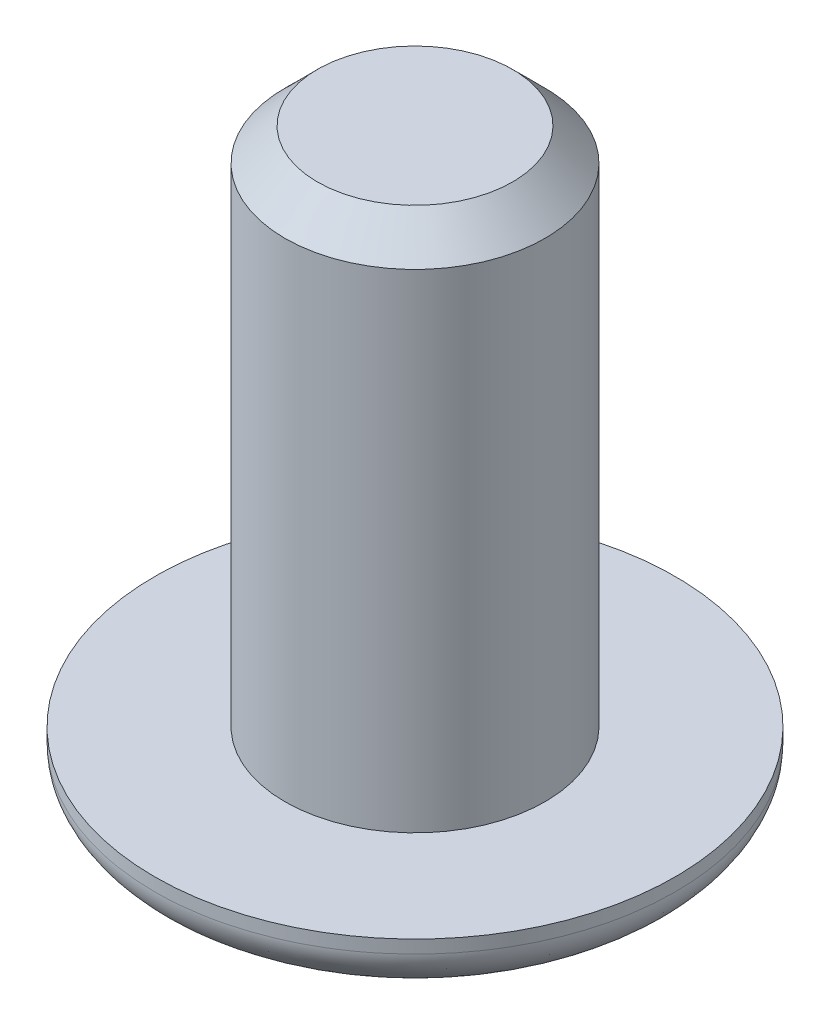
ISO-10303-21;
HEADER;
FILE_DESCRIPTION(('STEP AP214'),'2;1');
FILE_NAME('part.step','',(''),(''),'','','');
FILE_SCHEMA(('AUTOMOTIVE_DESIGN { 1 0 10303 214 1 1 1 1 }'));
ENDSEC;
DATA;
#1=APPLICATION_CONTEXT('core data for automotive mechanical design processes');
#2=APPLICATION_PROTOCOL_DEFINITION('international standard','automotive_design',2000,#1);
#3=PRODUCT_CONTEXT('',#1,'mechanical');
#4=PRODUCT('Part','Part','',(#3));
#5=PRODUCT_RELATED_PRODUCT_CATEGORY('part','',(#4));
#6=PRODUCT_DEFINITION_FORMATION('','',#4);
#7=PRODUCT_DEFINITION_CONTEXT('part definition',#1,'design');
#8=PRODUCT_DEFINITION('design','',#6,#7);
#9=PRODUCT_DEFINITION_SHAPE('','',#8);
#10=(LENGTH_UNIT() NAMED_UNIT(*) SI_UNIT(.MILLI.,.METRE.));
#11=(NAMED_UNIT(*) PLANE_ANGLE_UNIT() SI_UNIT($,.RADIAN.));
#12=(NAMED_UNIT(*) SI_UNIT($,.STERADIAN.) SOLID_ANGLE_UNIT());
#13=UNCERTAINTY_MEASURE_WITH_UNIT(LENGTH_MEASURE(1.E-05),#10,'distance_accuracy_value','');
#14=(GEOMETRIC_REPRESENTATION_CONTEXT(3) GLOBAL_UNCERTAINTY_ASSIGNED_CONTEXT((#13)) GLOBAL_UNIT_ASSIGNED_CONTEXT((#10,
#11,#12)) REPRESENTATION_CONTEXT('',''));
#15=CARTESIAN_POINT('',(0.,0.,0.));
#16=DIRECTION('',(0.,0.,1.));
#17=DIRECTION('',(1.,0.,0.));
#18=AXIS2_PLACEMENT_3D('',#15,#16,#17);
#19=CARTESIAN_POINT('',(0.,1.2,0.));
#20=DIRECTION('',(0.,1.,0.));
#21=DIRECTION('',(0.,0.,1.));
#22=AXIS2_PLACEMENT_3D('',#19,#20,#21);
#23=PLANE('',#22);
#24=CARTESIAN_POINT('',(0.,1.2,0.));
#25=DIRECTION('',(0.,1.,0.));
#26=DIRECTION('',(0.,0.,1.));
#27=AXIS2_PLACEMENT_3D('',#24,#25,#26);
#28=CIRCLE('',#27,2.);
#29=CARTESIAN_POINT('',(0.,1.2,2.));
#30=VERTEX_POINT('',#29);
#31=EDGE_CURVE('E314',#30,#30,#28,.T.);
#32=ORIENTED_EDGE('',*,*,#31,.F.);
#33=EDGE_LOOP('',(#32));
#34=FACE_BOUND('',#33,.T.);
#35=CARTESIAN_POINT('',(0.,1.2,0.));
#36=DIRECTION('',(0.,1.,0.));
#37=DIRECTION('',(0.,0.,1.));
#38=AXIS2_PLACEMENT_3D('',#35,#36,#37);
#39=CIRCLE('',#38,4.);
#40=CARTESIAN_POINT('',(0.,1.2,4.));
#41=VERTEX_POINT('',#40);
#42=EDGE_CURVE('E150',#41,#41,#39,.T.);
#43=ORIENTED_EDGE('',*,*,#42,.T.);
#44=EDGE_LOOP('',(#43));
#45=FACE_BOUND('',#44,.T.);
#46=ADVANCED_FACE('F44',(#34,#45),#23,.T.);
#47=CARTESIAN_POINT('',(0.,0.,0.));
#48=DIRECTION('',(0.,1.,0.));
#49=DIRECTION('',(0.,0.,1.));
#50=AXIS2_PLACEMENT_3D('',#47,#48,#49);
#51=PLANE('',#50);
#52=CARTESIAN_POINT('',(0.,0.,2.));
#53=CARTESIAN_POINT('',(0.261799376890833,0.,2.));
#54=CARTESIAN_POINT('',(0.523495778796538,0.,1.94794534916224));
#55=CARTESIAN_POINT('',(1.00723795066382,0.,1.74757278088291));
#56=CARTESIAN_POINT('',(1.22909344766315,0.,1.59933367708304));
#57=CARTESIAN_POINT('',(1.59933367708304,0.,1.22909344766315));
#58=CARTESIAN_POINT('',(1.74757278088293,0.,1.00723795066385));
#59=CARTESIAN_POINT('',(1.94794534916222,0.,0.52349577879651));
#60=CARTESIAN_POINT('',(2.,0.,0.261799376890842));
#61=CARTESIAN_POINT('',(2.,0.,-0.261799376890842));
#62=CARTESIAN_POINT('',(1.94794534916225,0.,-0.52349577879654));
#63=CARTESIAN_POINT('',(1.7475727808829,0.,-1.00723795066382));
#64=CARTESIAN_POINT('',(1.59933367708301,0.,-1.22909344766318));
#65=CARTESIAN_POINT('',(1.22909344766318,0.,-1.59933367708301));
#66=CARTESIAN_POINT('',(1.00723795066384,0.,-1.74757278088294));
#67=CARTESIAN_POINT('',(0.523495778796522,0.,-1.9479453491622));
#68=CARTESIAN_POINT('',(0.261799376890842,0.,-2.));
#69=CARTESIAN_POINT('',(-0.261799376890842,0.,-2.));
#70=CARTESIAN_POINT('',(-0.523495778796517,0.,-1.94794534916223));
#71=CARTESIAN_POINT('',(-1.00723795066384,0.,-1.74757278088292));
#72=CARTESIAN_POINT('',(-1.22909344766315,0.,-1.59933367708304));
#73=CARTESIAN_POINT('',(-1.59933367708304,0.,-1.22909344766315));
#74=CARTESIAN_POINT('',(-1.74757278088294,0.,-1.00723795066386));
#75=CARTESIAN_POINT('',(-1.94794534916221,0.,-0.523495778796506));
#76=CARTESIAN_POINT('',(-2.,0.,-0.261799376890839));
#77=CARTESIAN_POINT('',(-2.,0.,0.261799376890845));
#78=CARTESIAN_POINT('',(-1.94794534916221,0.,0.523495778796514));
#79=CARTESIAN_POINT('',(-1.74757278088294,0.,1.00723795066384));
#80=CARTESIAN_POINT('',(-1.59933367708301,0.,1.22909344766318));
#81=CARTESIAN_POINT('',(-1.22909344766319,0.,1.599333677083));
#82=CARTESIAN_POINT('',(-1.00723795066384,0.,1.74757278088294));
#83=CARTESIAN_POINT('',(-0.52349577879652,0.,1.94794534916221));
#84=CARTESIAN_POINT('',(-0.261799376890834,0.,2.));
#85=CARTESIAN_POINT('',(0.,0.,2.));
#86=(BOUNDED_CURVE() B_SPLINE_CURVE(3,(#52,#53,#54,#55,#56,#57,#58,#59,#60,#61,#62,#63,#64,#65,
#66,#67,#68,#69,#70,#71,#72,#73,#74,#75,#76,#77,#78,#79,#80,#81,#82,#83,#84,#85),.UNSPECIFIED.,
.T.,.F.) B_SPLINE_CURVE_WITH_KNOTS((4,2,2,2,2,2,2,2,2,2,2,2,2,2,2,2,4),(0.,0.392699081698724,
0.785398163397448,1.17809724509617,1.5707963267949,1.96349540849362,2.35619449019234,
2.74889357189107,3.14159265358979,3.53429173528852,3.92699081698724,4.31968989868597,
4.71238898038469,5.10508806208341,5.49778714378214,5.89048622548086,6.28318530717959),
.UNSPECIFIED.) CURVE() GEOMETRIC_REPRESENTATION_ITEM() RATIONAL_B_SPLINE_CURVE((1.,1.,1.,1.,1.,
1.,1.,1.,1.,1.,1.,1.,1.,1.,1.,1.,1.,1.,1.,1.,1.,1.,1.,1.,1.,1.,1.,1.,1.,1.,1.,1.,1.,1.)) REPRESENTATION_ITEM(''));
#87=CARTESIAN_POINT('',(0.,0.,2.));
#88=VERTEX_POINT('',#87);
#89=EDGE_CURVE('E12',#88,#88,#86,.F.);
#90=ORIENTED_EDGE('',*,*,#89,.T.);
#91=EDGE_LOOP('',(#90));
#92=FACE_BOUND('',#91,.T.);
#93=DIRECTION('',(0.5,0.,-0.866025403784439));
#94=VECTOR('',#93,1.);
#95=CARTESIAN_POINT('',(0.721687836487031,0.,1.25));
#96=LINE('',#95,#94);
#97=CARTESIAN_POINT('',(0.721687836487031,0.,1.25));
#98=VERTEX_POINT('',#97);
#99=CARTESIAN_POINT('',(1.44337567297406,0.,0.));
#100=VERTEX_POINT('',#99);
#101=EDGE_CURVE('E66',#98,#100,#96,.T.);
#102=ORIENTED_EDGE('',*,*,#101,.T.);
#103=DIRECTION('',(-0.5,0.,-0.866025403784439));
#104=VECTOR('',#103,1.);
#105=CARTESIAN_POINT('',(1.44337567297406,0.,0.));
#106=LINE('',#105,#104);
#107=CARTESIAN_POINT('',(0.721687836487031,0.,-1.25));
#108=VERTEX_POINT('',#107);
#109=EDGE_CURVE('E130',#100,#108,#106,.T.);
#110=ORIENTED_EDGE('',*,*,#109,.T.);
#111=DIRECTION('',(-1.,0.,0.));
#112=VECTOR('',#111,1.);
#113=CARTESIAN_POINT('',(0.721687836487031,0.,-1.25));
#114=LINE('',#113,#112);
#115=CARTESIAN_POINT('',(-0.721687836487033,0.,-1.25));
#116=VERTEX_POINT('',#115);
#117=EDGE_CURVE('E126',#108,#116,#114,.T.);
#118=ORIENTED_EDGE('',*,*,#117,.T.);
#119=DIRECTION('',(-0.5,0.,0.866025403784439));
#120=VECTOR('',#119,1.);
#121=CARTESIAN_POINT('',(-0.721687836487033,0.,-1.25));
#122=LINE('',#121,#120);
#123=CARTESIAN_POINT('',(-1.44337567297407,0.,0.));
#124=VERTEX_POINT('',#123);
#125=EDGE_CURVE('E102',#116,#124,#122,.T.);
#126=ORIENTED_EDGE('',*,*,#125,.T.);
#127=DIRECTION('',(0.5,0.,0.866025403784439));
#128=VECTOR('',#127,1.);
#129=CARTESIAN_POINT('',(-1.44337567297407,0.,0.));
#130=LINE('',#129,#128);
#131=CARTESIAN_POINT('',(-0.721687836487033,0.,1.25));
#132=VERTEX_POINT('',#131);
#133=EDGE_CURVE('E114',#124,#132,#130,.T.);
#134=ORIENTED_EDGE('',*,*,#133,.T.);
#135=DIRECTION('',(1.,0.,0.));
#136=VECTOR('',#135,1.);
#137=CARTESIAN_POINT('',(-0.721687836487033,0.,1.25));
#138=LINE('',#137,#136);
#139=EDGE_CURVE('E121',#132,#98,#138,.T.);
#140=ORIENTED_EDGE('',*,*,#139,.T.);
#141=EDGE_LOOP('',(#102,#110,#118,#126,#134,#140));
#142=FACE_BOUND('',#141,.T.);
#143=ADVANCED_FACE('F123',(#92,#142),#51,.F.);
#144=CARTESIAN_POINT('',(0.,1.2,0.));
#145=DIRECTION('',(0.,-1.,0.));
#146=DIRECTION('',(0.,0.,-1.));
#147=AXIS2_PLACEMENT_3D('',#144,#145,#146);
#148=CYLINDRICAL_SURFACE('',#147,4.);
#149=CARTESIAN_POINT('',(0.,1.,4.));
#150=CARTESIAN_POINT('',(-0.523598753781667,1.,4.));
#151=CARTESIAN_POINT('',(-1.04699155759304,1.,3.89589069832441));
#152=CARTESIAN_POINT('',(-2.01447590132769,1.,3.49514556176588));
#153=CARTESIAN_POINT('',(-2.45818689532638,1.,3.198667354166));
#154=CARTESIAN_POINT('',(-3.19866735416602,1.,2.45818689532636));
#155=CARTESIAN_POINT('',(-3.49514556176589,1.,2.01447590132768));
#156=CARTESIAN_POINT('',(-3.89589069832441,1.,1.04699155759303));
#157=CARTESIAN_POINT('',(-4.,1.,0.523598753781691));
#158=CARTESIAN_POINT('',(-4.,1.,-0.523598753781678));
#159=CARTESIAN_POINT('',(-3.89589069832442,1.,-1.04699155759301));
#160=CARTESIAN_POINT('',(-3.49514556176587,1.,-2.01447590132771));
#161=CARTESIAN_POINT('',(-3.19866735416608,1.,-2.4581868953263));
#162=CARTESIAN_POINT('',(-2.4581868953263,1.,-3.19866735416608));
#163=CARTESIAN_POINT('',(-2.01447590132769,1.,-3.49514556176588));
#164=CARTESIAN_POINT('',(-1.04699155759301,1.,-3.89589069832442));
#165=CARTESIAN_POINT('',(-0.523598753781683,1.,-4.));
#166=CARTESIAN_POINT('',(0.523598753781684,1.,-4.));
#167=CARTESIAN_POINT('',(1.04699155759304,1.,-3.89589069832441));
#168=CARTESIAN_POINT('',(2.01447590132768,1.,-3.49514556176588));
#169=CARTESIAN_POINT('',(2.45818689532636,1.,-3.19866735416603));
#170=CARTESIAN_POINT('',(3.19866735416602,1.,-2.45818689532636));
#171=CARTESIAN_POINT('',(3.49514556176589,1.,-2.01447590132768));
#172=CARTESIAN_POINT('',(3.89589069832441,1.,-1.04699155759304));
#173=CARTESIAN_POINT('',(4.,1.,-0.523598753781683));
#174=CARTESIAN_POINT('',(4.,1.,0.523598753781684));
#175=CARTESIAN_POINT('',(3.89589069832442,1.,1.04699155759301));
#176=CARTESIAN_POINT('',(3.49514556176588,1.,2.0144759013277));
#177=CARTESIAN_POINT('',(3.19866735416607,1.,2.45818689532631));
#178=CARTESIAN_POINT('',(2.45818689532631,1.,3.19866735416607));
#179=CARTESIAN_POINT('',(2.01447590132769,1.,3.49514556176588));
#180=CARTESIAN_POINT('',(1.04699155759303,1.,3.89589069832441));
#181=CARTESIAN_POINT('',(0.523598753781667,1.,4.));
#182=CARTESIAN_POINT('',(0.,1.,4.));
#183=(BOUNDED_CURVE() B_SPLINE_CURVE(3,(#149,#150,#151,#152,#153,#154,#155,#156,#157,#158,#159,
#160,#161,#162,#163,#164,#165,#166,#167,#168,#169,#170,#171,#172,#173,#174,#175,#176,#177,#178,
#179,#180,#181,#182),.UNSPECIFIED.,.T.,.F.) B_SPLINE_CURVE_WITH_KNOTS((4,2,2,2,2,2,2,2,2,2,2,2,
2,2,2,2,4),(0.,0.392699081698725,0.785398163397448,1.17809724509617,1.5707963267949,
1.96349540849362,2.35619449019234,2.74889357189107,3.14159265358979,3.53429173528852,
3.92699081698724,4.31968989868597,4.71238898038469,5.10508806208341,5.49778714378214,
5.89048622548086,6.28318530717959),
.UNSPECIFIED.) CURVE() GEOMETRIC_REPRESENTATION_ITEM() RATIONAL_B_SPLINE_CURVE((1.,1.,1.,1.,1.,
1.,1.,1.,1.,1.,1.,1.,1.,1.,1.,1.,1.,1.,1.,1.,1.,1.,1.,1.,1.,1.,1.,1.,1.,1.,1.,1.,1.,1.)) REPRESENTATION_ITEM(''));
#184=CARTESIAN_POINT('',(0.,1.,4.));
#185=VERTEX_POINT('',#184);
#186=EDGE_CURVE('E59',#185,#185,#183,.F.);
#187=ORIENTED_EDGE('',*,*,#186,.T.);
#188=EDGE_LOOP('',(#187));
#189=FACE_BOUND('',#188,.T.);
#190=ORIENTED_EDGE('',*,*,#42,.F.);
#191=EDGE_LOOP('',(#190));
#192=FACE_BOUND('',#191,.T.);
#193=ADVANCED_FACE('F171',(#189,#192),#148,.T.);
#194=CARTESIAN_POINT('',(0.721687836487031,1.2,1.25));
#195=DIRECTION('',(-0.866025403784439,0.,-0.5));
#196=DIRECTION('',(-0.5,0.,0.866025403784439));
#197=AXIS2_PLACEMENT_3D('',#194,#195,#196);
#198=PLANE('',#197);
#199=ORIENTED_EDGE('',*,*,#101,.F.);
#200=DIRECTION('',(0.,-1.,0.));
#201=VECTOR('',#200,1.);
#202=CARTESIAN_POINT('',(0.721687836487031,1.2,1.25));
#203=LINE('',#202,#201);
#204=CARTESIAN_POINT('',(0.721687836487031,1.2,1.25));
#205=VERTEX_POINT('',#204);
#206=EDGE_CURVE('E136',#205,#98,#203,.T.);
#207=ORIENTED_EDGE('',*,*,#206,.F.);
#208=DIRECTION('',(0.5,0.,-0.866025403784439));
#209=VECTOR('',#208,1.);
#210=CARTESIAN_POINT('',(0.721687836487031,1.2,1.25));
#211=LINE('',#210,#209);
#212=CARTESIAN_POINT('',(1.44337567297406,1.2,0.));
#213=VERTEX_POINT('',#212);
#214=EDGE_CURVE('E75',#205,#213,#211,.T.);
#215=ORIENTED_EDGE('',*,*,#214,.T.);
#216=DIRECTION('',(0.,-1.,0.));
#217=VECTOR('',#216,1.);
#218=CARTESIAN_POINT('',(1.44337567297406,1.2,0.));
#219=LINE('',#218,#217);
#220=EDGE_CURVE('E147',#213,#100,#219,.T.);
#221=ORIENTED_EDGE('',*,*,#220,.T.);
#222=EDGE_LOOP('',(#199,#207,#215,#221));
#223=FACE_BOUND('',#222,.T.);
#224=ADVANCED_FACE('F180',(#223),#198,.T.);
#225=CARTESIAN_POINT('',(1.44337567297406,1.2,0.));
#226=DIRECTION('',(-0.866025403784439,0.,0.5));
#227=DIRECTION('',(0.5,0.,0.866025403784439));
#228=AXIS2_PLACEMENT_3D('',#225,#226,#227);
#229=PLANE('',#228);
#230=ORIENTED_EDGE('',*,*,#109,.F.);
#231=ORIENTED_EDGE('',*,*,#220,.F.);
#232=DIRECTION('',(-0.5,0.,-0.866025403784439));
#233=VECTOR('',#232,1.);
#234=CARTESIAN_POINT('',(1.44337567297406,1.2,0.));
#235=LINE('',#234,#233);
#236=CARTESIAN_POINT('',(0.721687836487031,1.2,-1.25));
#237=VERTEX_POINT('',#236);
#238=EDGE_CURVE('E322',#213,#237,#235,.T.);
#239=ORIENTED_EDGE('',*,*,#238,.T.);
#240=DIRECTION('',(0.,-1.,0.));
#241=VECTOR('',#240,1.);
#242=CARTESIAN_POINT('',(0.721687836487031,1.2,-1.25));
#243=LINE('',#242,#241);
#244=EDGE_CURVE('E144',#237,#108,#243,.T.);
#245=ORIENTED_EDGE('',*,*,#244,.T.);
#246=EDGE_LOOP('',(#230,#231,#239,#245));
#247=FACE_BOUND('',#246,.T.);
#248=ADVANCED_FACE('F211',(#247),#229,.T.);
#249=CARTESIAN_POINT('',(0.721687836487031,1.2,-1.25));
#250=DIRECTION('',(0.,0.,1.));
#251=DIRECTION('',(1.,0.,0.));
#252=AXIS2_PLACEMENT_3D('',#249,#250,#251);
#253=PLANE('',#252);
#254=ORIENTED_EDGE('',*,*,#117,.F.);
#255=ORIENTED_EDGE('',*,*,#244,.F.);
#256=DIRECTION('',(-1.,0.,0.));
#257=VECTOR('',#256,1.);
#258=CARTESIAN_POINT('',(0.721687836487031,1.2,-1.25));
#259=LINE('',#258,#257);
#260=CARTESIAN_POINT('',(-0.721687836487033,1.2,-1.25));
#261=VERTEX_POINT('',#260);
#262=EDGE_CURVE('E326',#237,#261,#259,.T.);
#263=ORIENTED_EDGE('',*,*,#262,.T.);
#264=DIRECTION('',(0.,-1.,0.));
#265=VECTOR('',#264,1.);
#266=CARTESIAN_POINT('',(-0.721687836487033,1.2,-1.25));
#267=LINE('',#266,#265);
#268=EDGE_CURVE('E110',#261,#116,#267,.T.);
#269=ORIENTED_EDGE('',*,*,#268,.T.);
#270=EDGE_LOOP('',(#254,#255,#263,#269));
#271=FACE_BOUND('',#270,.T.);
#272=ADVANCED_FACE('F214',(#271),#253,.T.);
#273=CARTESIAN_POINT('',(-0.721687836487033,1.2,-1.25));
#274=DIRECTION('',(0.866025403784439,0.,0.5));
#275=DIRECTION('',(0.5,0.,-0.866025403784439));
#276=AXIS2_PLACEMENT_3D('',#273,#274,#275);
#277=PLANE('',#276);
#278=ORIENTED_EDGE('',*,*,#125,.F.);
#279=ORIENTED_EDGE('',*,*,#268,.F.);
#280=DIRECTION('',(-0.5,0.,0.866025403784439));
#281=VECTOR('',#280,1.);
#282=CARTESIAN_POINT('',(-0.721687836487033,1.2,-1.25));
#283=LINE('',#282,#281);
#284=CARTESIAN_POINT('',(-1.44337567297407,1.2,0.));
#285=VERTEX_POINT('',#284);
#286=EDGE_CURVE('E106',#261,#285,#283,.T.);
#287=ORIENTED_EDGE('',*,*,#286,.T.);
#288=DIRECTION('',(0.,-1.,0.));
#289=VECTOR('',#288,1.);
#290=CARTESIAN_POINT('',(-1.44337567297407,1.2,0.));
#291=LINE('',#290,#289);
#292=EDGE_CURVE('E97',#285,#124,#291,.T.);
#293=ORIENTED_EDGE('',*,*,#292,.T.);
#294=EDGE_LOOP('',(#278,#279,#287,#293));
#295=FACE_BOUND('',#294,.T.);
#296=ADVANCED_FACE('F99',(#295),#277,.T.);
#297=CARTESIAN_POINT('',(-1.44337567297407,1.2,0.));
#298=DIRECTION('',(0.866025403784439,0.,-0.5));
#299=DIRECTION('',(-0.5,0.,-0.866025403784439));
#300=AXIS2_PLACEMENT_3D('',#297,#298,#299);
#301=PLANE('',#300);
#302=ORIENTED_EDGE('',*,*,#133,.F.);
#303=ORIENTED_EDGE('',*,*,#292,.F.);
#304=DIRECTION('',(0.5,0.,0.866025403784439));
#305=VECTOR('',#304,1.);
#306=CARTESIAN_POINT('',(-1.44337567297407,1.2,0.));
#307=LINE('',#306,#305);
#308=CARTESIAN_POINT('',(-0.721687836487033,1.2,1.25));
#309=VERTEX_POINT('',#308);
#310=EDGE_CURVE('E332',#285,#309,#307,.T.);
#311=ORIENTED_EDGE('',*,*,#310,.T.);
#312=DIRECTION('',(0.,-1.,0.));
#313=VECTOR('',#312,1.);
#314=CARTESIAN_POINT('',(-0.721687836487033,1.2,1.25));
#315=LINE('',#314,#313);
#316=EDGE_CURVE('E111',#309,#132,#315,.T.);
#317=ORIENTED_EDGE('',*,*,#316,.T.);
#318=EDGE_LOOP('',(#302,#303,#311,#317));
#319=FACE_BOUND('',#318,.T.);
#320=ADVANCED_FACE('F115',(#319),#301,.T.);
#321=CARTESIAN_POINT('',(-0.721687836487033,1.2,1.25));
#322=DIRECTION('',(0.,0.,-1.));
#323=DIRECTION('',(-1.,0.,0.));
#324=AXIS2_PLACEMENT_3D('',#321,#322,#323);
#325=PLANE('',#324);
#326=ORIENTED_EDGE('',*,*,#139,.F.);
#327=ORIENTED_EDGE('',*,*,#316,.F.);
#328=DIRECTION('',(1.,0.,0.));
#329=VECTOR('',#328,1.);
#330=CARTESIAN_POINT('',(-0.721687836487033,1.2,1.25));
#331=LINE('',#330,#329);
#332=EDGE_CURVE('E139',#309,#205,#331,.T.);
#333=ORIENTED_EDGE('',*,*,#332,.T.);
#334=ORIENTED_EDGE('',*,*,#206,.T.);
#335=EDGE_LOOP('',(#326,#327,#333,#334));
#336=FACE_BOUND('',#335,.T.);
#337=ADVANCED_FACE('F223',(#336),#325,.T.);
#338=CARTESIAN_POINT('',(0.,1.2,0.));
#339=DIRECTION('',(0.,1.,0.));
#340=DIRECTION('',(0.,0.,1.));
#341=AXIS2_PLACEMENT_3D('',#338,#339,#340);
#342=PLANE('',#341);
#343=ORIENTED_EDGE('',*,*,#214,.F.);
#344=ORIENTED_EDGE('',*,*,#332,.F.);
#345=ORIENTED_EDGE('',*,*,#310,.F.);
#346=ORIENTED_EDGE('',*,*,#286,.F.);
#347=ORIENTED_EDGE('',*,*,#262,.F.);
#348=ORIENTED_EDGE('',*,*,#238,.F.);
#349=EDGE_LOOP('',(#343,#344,#345,#346,#347,#348));
#350=FACE_BOUND('',#349,.T.);
#351=ADVANCED_FACE('F226',(#350),#342,.F.);
#352=CARTESIAN_POINT('',(0.,9.2,0.));
#353=DIRECTION('',(0.,-1.,0.));
#354=DIRECTION('',(0.,0.,-1.));
#355=AXIS2_PLACEMENT_3D('',#352,#353,#354);
#356=CYLINDRICAL_SURFACE('',#355,2.);
#357=CARTESIAN_POINT('',(0.,8.7,0.));
#358=DIRECTION('',(0.,1.,0.));
#359=DIRECTION('',(0.,0.,1.));
#360=AXIS2_PLACEMENT_3D('',#357,#358,#359);
#361=CIRCLE('',#360,2.);
#362=CARTESIAN_POINT('',(0.,8.7,2.));
#363=VERTEX_POINT('',#362);
#364=EDGE_CURVE('E158',#363,#363,#361,.F.);
#365=ORIENTED_EDGE('',*,*,#364,.T.);
#366=EDGE_LOOP('',(#365));
#367=FACE_BOUND('',#366,.T.);
#368=ORIENTED_EDGE('',*,*,#31,.T.);
#369=EDGE_LOOP('',(#368));
#370=FACE_BOUND('',#369,.T.);
#371=ADVANCED_FACE('F195',(#367,#370),#356,.T.);
#372=CARTESIAN_POINT('',(0.,9.2,0.));
#373=DIRECTION('',(0.,1.,0.));
#374=DIRECTION('',(0.,0.,1.));
#375=AXIS2_PLACEMENT_3D('',#372,#373,#374);
#376=PLANE('',#375);
#377=CARTESIAN_POINT('',(0.,9.2,0.));
#378=DIRECTION('',(0.,1.,0.));
#379=DIRECTION('',(0.,0.,1.));
#380=AXIS2_PLACEMENT_3D('',#377,#378,#379);
#381=CIRCLE('',#380,1.5);
#382=CARTESIAN_POINT('',(0.,9.2,1.5));
#383=VERTEX_POINT('',#382);
#384=EDGE_CURVE('E154',#383,#383,#381,.T.);
#385=ORIENTED_EDGE('',*,*,#384,.T.);
#386=EDGE_LOOP('',(#385));
#387=FACE_BOUND('',#386,.T.);
#388=ADVANCED_FACE('F188',(#387),#376,.T.);
#389=CARTESIAN_POINT('',(0.,9.2,0.));
#390=DIRECTION('',(0.,-1.,0.));
#391=DIRECTION('',(0.,0.,-1.));
#392=AXIS2_PLACEMENT_3D('',#389,#390,#391);
#393=CONICAL_SURFACE('',#392,1.5,0.785398163397447);
#394=ORIENTED_EDGE('',*,*,#364,.F.);
#395=EDGE_LOOP('',(#394));
#396=FACE_BOUND('',#395,.T.);
#397=ORIENTED_EDGE('',*,*,#384,.F.);
#398=EDGE_LOOP('',(#397));
#399=FACE_BOUND('',#398,.T.);
#400=ADVANCED_FACE('F184',(#396,#399),#393,.T.);
#401=CARTESIAN_POINT('',(0.,1.,4.));
#402=CARTESIAN_POINT('',(0.523598753781667,1.,4.));
#403=CARTESIAN_POINT('',(1.04699155759303,1.,3.89589069832441));
#404=CARTESIAN_POINT('',(2.01447590132769,1.,3.49514556176588));
#405=CARTESIAN_POINT('',(2.45818689532631,1.,3.19866735416607));
#406=CARTESIAN_POINT('',(3.19866735416607,1.,2.45818689532631));
#407=CARTESIAN_POINT('',(3.49514556176588,1.,2.0144759013277));
#408=CARTESIAN_POINT('',(3.89589069832442,1.,1.04699155759301));
#409=CARTESIAN_POINT('',(4.,1.,0.523598753781684));
#410=CARTESIAN_POINT('',(4.,1.,-0.523598753781683));
#411=CARTESIAN_POINT('',(3.89589069832441,1.,-1.04699155759304));
#412=CARTESIAN_POINT('',(3.49514556176589,1.,-2.01447590132768));
#413=CARTESIAN_POINT('',(3.19866735416602,1.,-2.45818689532636));
#414=CARTESIAN_POINT('',(2.45818689532636,1.,-3.19866735416603));
#415=CARTESIAN_POINT('',(2.01447590132768,1.,-3.49514556176588));
#416=CARTESIAN_POINT('',(1.04699155759304,1.,-3.89589069832441));
#417=CARTESIAN_POINT('',(0.523598753781684,1.,-4.));
#418=CARTESIAN_POINT('',(-0.523598753781683,1.,-4.));
#419=CARTESIAN_POINT('',(-1.04699155759301,1.,-3.89589069832442));
#420=CARTESIAN_POINT('',(-2.01447590132769,1.,-3.49514556176588));
#421=CARTESIAN_POINT('',(-2.4581868953263,1.,-3.19866735416608));
#422=CARTESIAN_POINT('',(-3.19866735416608,1.,-2.4581868953263));
#423=CARTESIAN_POINT('',(-3.49514556176587,1.,-2.01447590132771));
#424=CARTESIAN_POINT('',(-3.89589069832442,1.,-1.04699155759301));
#425=CARTESIAN_POINT('',(-4.,1.,-0.523598753781678));
#426=CARTESIAN_POINT('',(-4.,1.,0.523598753781691));
#427=CARTESIAN_POINT('',(-3.89589069832441,1.,1.04699155759303));
#428=CARTESIAN_POINT('',(-3.49514556176589,1.,2.01447590132768));
#429=CARTESIAN_POINT('',(-3.19866735416602,1.,2.45818689532636));
#430=CARTESIAN_POINT('',(-2.45818689532638,1.,3.198667354166));
#431=CARTESIAN_POINT('',(-2.01447590132769,1.,3.49514556176588));
#432=CARTESIAN_POINT('',(-1.04699155759304,1.,3.89589069832441));
#433=CARTESIAN_POINT('',(-0.523598753781667,1.,4.));
#434=CARTESIAN_POINT('',(0.,1.,4.));
#435=CARTESIAN_POINT('',(0.,0.,4.));
#436=CARTESIAN_POINT('',(0.523598753781667,0.,4.));
#437=CARTESIAN_POINT('',(1.04699155759308,0.,3.89589069832453));
#438=CARTESIAN_POINT('',(2.01447590132764,0.,3.49514556176576));
#439=CARTESIAN_POINT('',(2.45818689532636,0.,3.19866735416602));
#440=CARTESIAN_POINT('',(3.19866735416602,0.,2.45818689532636));
#441=CARTESIAN_POINT('',(3.49514556176586,0.,2.01447590132772));
#442=CARTESIAN_POINT('',(3.89589069832444,0.,1.04699155759299));
#443=CARTESIAN_POINT('',(4.,0.,0.523598753781684));
#444=CARTESIAN_POINT('',(4.,0.,-0.523598753781683));
#445=CARTESIAN_POINT('',(3.89589069832444,0.,-1.04699155759302));
#446=CARTESIAN_POINT('',(3.49514556176585,0.,-2.0144759013277));
#447=CARTESIAN_POINT('',(3.19866735416602,0.,-2.4581868953263));
#448=CARTESIAN_POINT('',(2.45818689532636,0.,-3.19866735416608));
#449=CARTESIAN_POINT('',(2.01447590132768,0.,-3.49514556176594));
#450=CARTESIAN_POINT('',(1.04699155759304,0.,-3.89589069832435));
#451=CARTESIAN_POINT('',(0.523598753781684,0.,-4.));
#452=CARTESIAN_POINT('',(-0.523598753781683,0.,-4.));
#453=CARTESIAN_POINT('',(-1.04699155759303,0.,-3.89589069832447));
#454=CARTESIAN_POINT('',(-2.01447590132767,0.,-3.49514556176583));
#455=CARTESIAN_POINT('',(-2.4581868953263,0.,-3.19866735416614));
#456=CARTESIAN_POINT('',(-3.19866735416608,0.,-2.45818689532624));
#457=CARTESIAN_POINT('',(-3.49514556176576,0.,-2.01447590132774));
#458=CARTESIAN_POINT('',(-3.89589069832453,0.,-1.04699155759298));
#459=CARTESIAN_POINT('',(-4.,0.,-0.523598753781678));
#460=CARTESIAN_POINT('',(-4.,0.,0.523598753781691));
#461=CARTESIAN_POINT('',(-3.89589069832447,0.,1.04699155759303));
#462=CARTESIAN_POINT('',(-3.49514556176582,0.,2.01447590132768));
#463=CARTESIAN_POINT('',(-3.19866735416596,0.,2.45818689532636));
#464=CARTESIAN_POINT('',(-2.45818689532643,0.,3.198667354166));
#465=CARTESIAN_POINT('',(-2.01447590132766,0.,3.49514556176576));
#466=CARTESIAN_POINT('',(-1.04699155759307,0.,3.89589069832453));
#467=CARTESIAN_POINT('',(-0.523598753781667,0.,4.));
#468=CARTESIAN_POINT('',(0.,0.,4.));
#469=CARTESIAN_POINT('',(0.,0.,2.));
#470=CARTESIAN_POINT('',(0.261799376890833,0.,2.));
#471=CARTESIAN_POINT('',(0.523495778796538,0.,1.94794534916224));
#472=CARTESIAN_POINT('',(1.00723795066382,0.,1.74757278088291));
#473=CARTESIAN_POINT('',(1.22909344766315,0.,1.59933367708304));
#474=CARTESIAN_POINT('',(1.59933367708304,0.,1.22909344766315));
#475=CARTESIAN_POINT('',(1.74757278088293,0.,1.00723795066385));
#476=CARTESIAN_POINT('',(1.94794534916222,0.,0.52349577879651));
#477=CARTESIAN_POINT('',(2.,0.,0.261799376890842));
#478=CARTESIAN_POINT('',(2.,0.,-0.261799376890842));
#479=CARTESIAN_POINT('',(1.94794534916225,0.,-0.52349577879654));
#480=CARTESIAN_POINT('',(1.7475727808829,0.,-1.00723795066382));
#481=CARTESIAN_POINT('',(1.59933367708301,0.,-1.22909344766318));
#482=CARTESIAN_POINT('',(1.22909344766318,0.,-1.59933367708301));
#483=CARTESIAN_POINT('',(1.00723795066384,0.,-1.74757278088294));
#484=CARTESIAN_POINT('',(0.523495778796522,0.,-1.9479453491622));
#485=CARTESIAN_POINT('',(0.261799376890842,0.,-2.));
#486=CARTESIAN_POINT('',(-0.261799376890842,0.,-2.));
#487=CARTESIAN_POINT('',(-0.523495778796517,0.,-1.94794534916223));
#488=CARTESIAN_POINT('',(-1.00723795066384,0.,-1.74757278088292));
#489=CARTESIAN_POINT('',(-1.22909344766315,0.,-1.59933367708304));
#490=CARTESIAN_POINT('',(-1.59933367708304,0.,-1.22909344766315));
#491=CARTESIAN_POINT('',(-1.74757278088294,0.,-1.00723795066386));
#492=CARTESIAN_POINT('',(-1.94794534916221,0.,-0.523495778796506));
#493=CARTESIAN_POINT('',(-2.,0.,-0.261799376890839));
#494=CARTESIAN_POINT('',(-2.,0.,0.261799376890845));
#495=CARTESIAN_POINT('',(-1.94794534916221,0.,0.523495778796514));
#496=CARTESIAN_POINT('',(-1.74757278088294,0.,1.00723795066384));
#497=CARTESIAN_POINT('',(-1.59933367708301,0.,1.22909344766318));
#498=CARTESIAN_POINT('',(-1.22909344766319,0.,1.599333677083));
#499=CARTESIAN_POINT('',(-1.00723795066384,0.,1.74757278088294));
#500=CARTESIAN_POINT('',(-0.52349577879652,0.,1.94794534916221));
#501=CARTESIAN_POINT('',(-0.261799376890834,0.,2.));
#502=CARTESIAN_POINT('',(0.,0.,2.));
#503=(BOUNDED_SURFACE() B_SPLINE_SURFACE(2,3,((#401,#402,#403,#404,#405,#406,#407,#408,#409,
#410,#411,#412,#413,#414,#415,#416,#417,#418,#419,#420,#421,#422,#423,#424,#425,#426,#427,#428,
#429,#430,#431,#432,#433,#434),(#435,#436,#437,#438,#439,#440,#441,#442,#443,#444,#445,#446,
#447,#448,#449,#450,#451,#452,#453,#454,#455,#456,#457,#458,#459,#460,#461,#462,#463,#464,#465,
#466,#467,#468),(#469,#470,#471,#472,#473,#474,#475,#476,#477,#478,#479,#480,#481,#482,#483,
#484,#485,#486,#487,#488,#489,#490,#491,#492,#493,#494,#495,#496,#497,#498,#499,#500,#501,
#502)),.UNSPECIFIED.,.F.,.T.,.F.) B_SPLINE_SURFACE_WITH_KNOTS((3,3),(4,2,2,2,2,2,2,2,2,2,2,2,2,
2,2,2,4),(0.,1.),(0.,0.392699081698724,0.785398163397448,1.17809724509617,1.5707963267949,
1.96349540849362,2.35619449019234,2.74889357189107,3.14159265358979,3.53429173528852,
3.92699081698724,4.31968989868597,4.71238898038469,5.10508806208341,5.49778714378214,
5.89048622548086,6.28318530717959),
.UNSPECIFIED.) GEOMETRIC_REPRESENTATION_ITEM() RATIONAL_B_SPLINE_SURFACE(((1.,1.,1.,1.,1.,1.,1.,
1.,1.,1.,1.,1.,1.,1.,1.,1.,1.,1.,1.,1.,1.,1.,1.,1.,1.,1.,1.,1.,1.,1.,1.,1.,1.,1.),
(0.707106781186548,0.707106781186548,0.707106781186548,0.707106781186548,0.707106781186548,
0.707106781186548,0.707106781186548,0.707106781186548,0.707106781186548,0.707106781186548,
0.707106781186548,0.707106781186548,0.707106781186548,0.707106781186548,0.707106781186548,
0.707106781186548,0.707106781186548,0.707106781186548,0.707106781186548,0.707106781186548,
0.707106781186548,0.707106781186548,0.707106781186548,0.707106781186548,0.707106781186548,
0.707106781186548,0.707106781186548,0.707106781186548,0.707106781186547,0.707106781186547,
0.707106781186548,0.707106781186548,0.707106781186548,0.707106781186548),(1.,1.,1.,1.,1.,1.,1.,
1.,1.,1.,1.,1.,1.,1.,1.,1.,1.,1.,1.,1.,1.,1.,1.,1.,1.,1.,1.,1.,1.,1.,1.,1.,1.,1.))) REPRESENTATION_ITEM('') SURFACE());
#504=ORIENTED_EDGE('',*,*,#89,.F.);
#505=EDGE_LOOP('',(#504));
#506=FACE_BOUND('',#505,.T.);
#507=ORIENTED_EDGE('',*,*,#186,.F.);
#508=EDGE_LOOP('',(#507));
#509=FACE_BOUND('',#508,.T.);
#510=ADVANCED_FACE('F47',(#506,#509),#503,.T.);
#511=CLOSED_SHELL('',(#46,#143,#193,#224,#248,#272,#296,#320,#337,#351,#371,#388,#400,#510));
#512=MANIFOLD_SOLID_BREP('B2',#511);
#513=ADVANCED_BREP_SHAPE_REPRESENTATION('',(#18,#512),#14);
#514=SHAPE_DEFINITION_REPRESENTATION(#9,#513);
ENDSEC;
END-ISO-10303-21;
